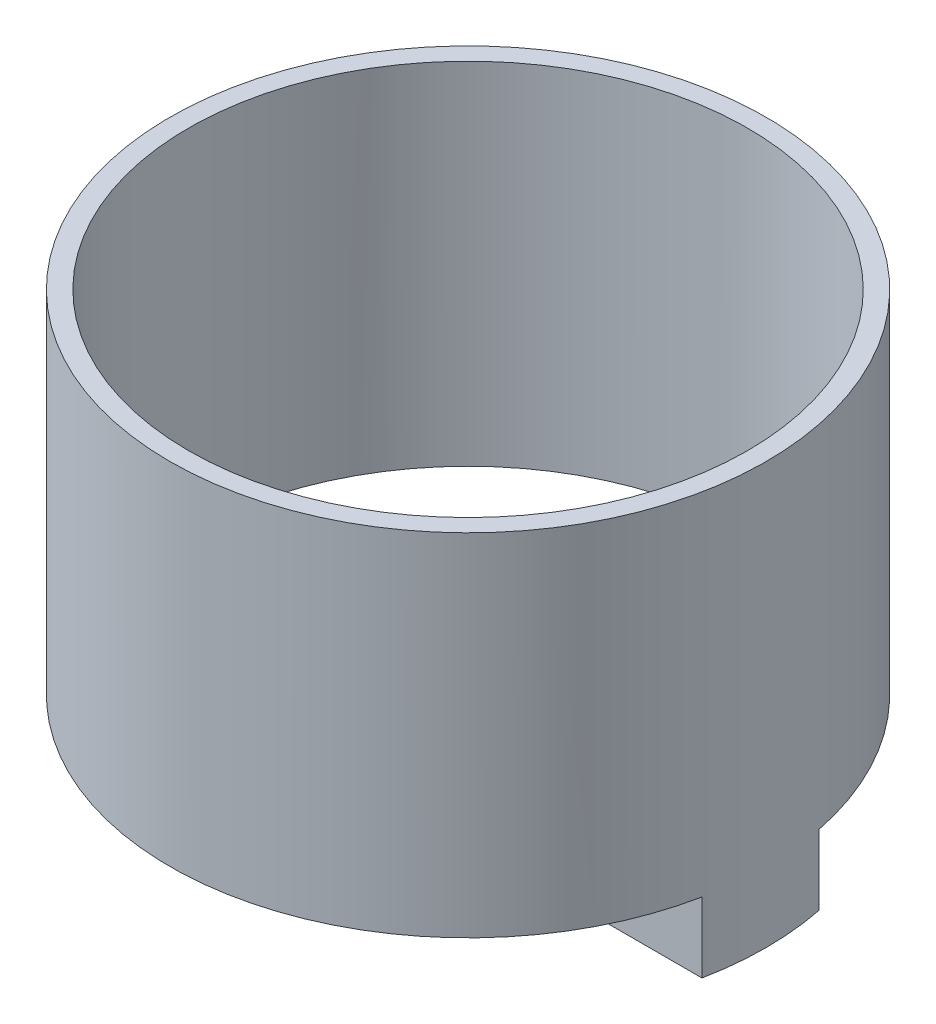
ISO-10303-21;
HEADER;
FILE_DESCRIPTION(('STEP AP214'),'2;1');
FILE_NAME('part.step','',(''),(''),'','','');
FILE_SCHEMA(('AUTOMOTIVE_DESIGN { 1 0 10303 214 1 1 1 1 }'));
ENDSEC;
DATA;
#1=APPLICATION_CONTEXT('core data for automotive mechanical design processes');
#2=APPLICATION_PROTOCOL_DEFINITION('international standard','automotive_design',2000,#1);
#3=PRODUCT_CONTEXT('',#1,'mechanical');
#4=PRODUCT('Part','Part','',(#3));
#5=PRODUCT_RELATED_PRODUCT_CATEGORY('part','',(#4));
#6=PRODUCT_DEFINITION_FORMATION('','',#4);
#7=PRODUCT_DEFINITION_CONTEXT('part definition',#1,'design');
#8=PRODUCT_DEFINITION('design','',#6,#7);
#9=PRODUCT_DEFINITION_SHAPE('','',#8);
#10=(LENGTH_UNIT() NAMED_UNIT(*) SI_UNIT(.MILLI.,.METRE.));
#11=(NAMED_UNIT(*) PLANE_ANGLE_UNIT() SI_UNIT($,.RADIAN.));
#12=(NAMED_UNIT(*) SI_UNIT($,.STERADIAN.) SOLID_ANGLE_UNIT());
#13=UNCERTAINTY_MEASURE_WITH_UNIT(LENGTH_MEASURE(1.E-05),#10,'distance_accuracy_value','');
#14=(GEOMETRIC_REPRESENTATION_CONTEXT(3) GLOBAL_UNCERTAINTY_ASSIGNED_CONTEXT((#13)) GLOBAL_UNIT_ASSIGNED_CONTEXT((#10,
#11,#12)) REPRESENTATION_CONTEXT('',''));
#15=CARTESIAN_POINT('',(0.,0.,0.));
#16=DIRECTION('',(0.,0.,1.));
#17=DIRECTION('',(1.,0.,0.));
#18=AXIS2_PLACEMENT_3D('',#15,#16,#17);
#19=CARTESIAN_POINT('',(0.,0.,0.));
#20=DIRECTION('',(0.,1.,0.));
#21=DIRECTION('',(0.,0.,1.));
#22=AXIS2_PLACEMENT_3D('',#19,#20,#21);
#23=PLANE('',#22);
#24=DIRECTION('',(1.,0.,0.));
#25=VECTOR('',#24,1.);
#26=CARTESIAN_POINT('',(-5.24999999999999,0.,-2.49999999999986));
#27=LINE('',#26,#25);
#28=CARTESIAN_POINT('',(-12.50249975005,0.,-2.5));
#29=VERTEX_POINT('',#28);
#30=CARTESIAN_POINT('',(-11.6855680221374,0.,-2.49999999999999));
#31=VERTEX_POINT('',#30);
#32=EDGE_CURVE('E69',#29,#31,#27,.T.);
#33=ORIENTED_EDGE('',*,*,#32,.F.);
#34=CARTESIAN_POINT('',(0.,0.,0.));
#35=DIRECTION('',(0.,1.,0.));
#36=DIRECTION('',(0.,0.,1.));
#37=AXIS2_PLACEMENT_3D('',#34,#35,#36);
#38=CIRCLE('',#37,12.75);
#39=CARTESIAN_POINT('',(12.50249975005,0.,-2.5));
#40=VERTEX_POINT('',#39);
#41=EDGE_CURVE('E47',#40,#29,#38,.T.);
#42=ORIENTED_EDGE('',*,*,#41,.F.);
#43=DIRECTION('',(1.,0.,0.));
#44=VECTOR('',#43,1.);
#45=CARTESIAN_POINT('',(5.25,0.,-2.5));
#46=LINE('',#45,#44);
#47=CARTESIAN_POINT('',(11.6855680221374,0.,-2.5));
#48=VERTEX_POINT('',#47);
#49=EDGE_CURVE('E11',#48,#40,#46,.T.);
#50=ORIENTED_EDGE('',*,*,#49,.F.);
#51=CARTESIAN_POINT('',(0.,0.,0.));
#52=DIRECTION('',(0.,1.,0.));
#53=DIRECTION('',(0.,0.,1.));
#54=AXIS2_PLACEMENT_3D('',#51,#52,#53);
#55=CIRCLE('',#54,11.95);
#56=EDGE_CURVE('E197',#48,#31,#55,.T.);
#57=ORIENTED_EDGE('',*,*,#56,.T.);
#58=EDGE_LOOP('',(#33,#42,#50,#57));
#59=FACE_BOUND('',#58,.T.);
#60=ADVANCED_FACE('F43',(#59),#23,.F.);
#61=DIRECTION('',(-1.,0.,0.));
#62=VECTOR('',#61,1.);
#63=CARTESIAN_POINT('',(-5.24999999999986,0.,2.50000000000014));
#64=LINE('',#63,#62);
#65=CARTESIAN_POINT('',(-11.6855680221374,0.,2.50000000000001));
#66=VERTEX_POINT('',#65);
#67=CARTESIAN_POINT('',(-12.50249975005,0.,2.5));
#68=VERTEX_POINT('',#67);
#69=EDGE_CURVE('E150',#66,#68,#64,.T.);
#70=ORIENTED_EDGE('',*,*,#69,.F.);
#71=CARTESIAN_POINT('',(11.6855680221374,0.,2.5));
#72=VERTEX_POINT('',#71);
#73=EDGE_CURVE('E191',#66,#72,#55,.T.);
#74=ORIENTED_EDGE('',*,*,#73,.T.);
#75=DIRECTION('',(-1.,0.,0.));
#76=VECTOR('',#75,1.);
#77=CARTESIAN_POINT('',(5.25,0.,2.5));
#78=LINE('',#77,#76);
#79=CARTESIAN_POINT('',(12.50249975005,0.,2.5));
#80=VERTEX_POINT('',#79);
#81=EDGE_CURVE('E174',#80,#72,#78,.T.);
#82=ORIENTED_EDGE('',*,*,#81,.F.);
#83=EDGE_CURVE('E61',#68,#80,#38,.T.);
#84=ORIENTED_EDGE('',*,*,#83,.F.);
#85=EDGE_LOOP('',(#70,#74,#82,#84));
#86=FACE_BOUND('',#85,.T.);
#87=ADVANCED_FACE('F208',(#86),#23,.F.);
#88=CARTESIAN_POINT('',(0.,15.,0.));
#89=DIRECTION('',(0.,1.,0.));
#90=DIRECTION('',(0.,0.,1.));
#91=AXIS2_PLACEMENT_3D('',#88,#89,#90);
#92=PLANE('',#91);
#93=CARTESIAN_POINT('',(0.,15.,0.));
#94=DIRECTION('',(0.,1.,0.));
#95=DIRECTION('',(0.,0.,1.));
#96=AXIS2_PLACEMENT_3D('',#93,#94,#95);
#97=CIRCLE('',#96,12.75);
#98=CARTESIAN_POINT('',(0.,15.,12.75));
#99=VERTEX_POINT('',#98);
#100=EDGE_CURVE('E52',#99,#99,#97,.T.);
#101=ORIENTED_EDGE('',*,*,#100,.T.);
#102=EDGE_LOOP('',(#101));
#103=FACE_BOUND('',#102,.T.);
#104=CARTESIAN_POINT('',(0.,15.,0.));
#105=DIRECTION('',(0.,1.,0.));
#106=DIRECTION('',(0.,0.,1.));
#107=AXIS2_PLACEMENT_3D('',#104,#105,#106);
#108=CIRCLE('',#107,11.95);
#109=CARTESIAN_POINT('',(0.,15.,11.95));
#110=VERTEX_POINT('',#109);
#111=EDGE_CURVE('E192',#110,#110,#108,.T.);
#112=ORIENTED_EDGE('',*,*,#111,.F.);
#113=EDGE_LOOP('',(#112));
#114=FACE_BOUND('',#113,.T.);
#115=ADVANCED_FACE('F244',(#103,#114),#92,.T.);
#116=CARTESIAN_POINT('',(0.,15.,0.));
#117=DIRECTION('',(0.,-1.,0.));
#118=DIRECTION('',(0.,0.,-1.));
#119=AXIS2_PLACEMENT_3D('',#116,#117,#118);
#120=CYLINDRICAL_SURFACE('',#119,12.75);
#121=ORIENTED_EDGE('',*,*,#100,.F.);
#122=EDGE_LOOP('',(#121));
#123=FACE_BOUND('',#122,.T.);
#124=ORIENTED_EDGE('',*,*,#41,.T.);
#125=DIRECTION('',(0.,1.,0.));
#126=VECTOR('',#125,1.);
#127=CARTESIAN_POINT('',(-12.50249975005,-3.,-2.5));
#128=LINE('',#127,#126);
#129=CARTESIAN_POINT('',(-12.50249975005,-3.,-2.5));
#130=VERTEX_POINT('',#129);
#131=EDGE_CURVE('E362',#130,#29,#128,.T.);
#132=ORIENTED_EDGE('',*,*,#131,.F.);
#133=CARTESIAN_POINT('',(0.,-3.,0.));
#134=DIRECTION('',(0.,-1.,0.));
#135=DIRECTION('',(0.,0.,-1.));
#136=AXIS2_PLACEMENT_3D('',#133,#134,#135);
#137=CIRCLE('',#136,12.7500000000001);
#138=CARTESIAN_POINT('',(-12.50249975005,-3.,2.5));
#139=VERTEX_POINT('',#138);
#140=EDGE_CURVE('E152',#139,#130,#137,.T.);
#141=ORIENTED_EDGE('',*,*,#140,.F.);
#142=DIRECTION('',(0.,1.,0.));
#143=VECTOR('',#142,1.);
#144=CARTESIAN_POINT('',(-12.50249975005,-3.,2.5));
#145=LINE('',#144,#143);
#146=EDGE_CURVE('E145',#139,#68,#145,.T.);
#147=ORIENTED_EDGE('',*,*,#146,.T.);
#148=ORIENTED_EDGE('',*,*,#83,.T.);
#149=DIRECTION('',(0.,1.,0.));
#150=VECTOR('',#149,1.);
#151=CARTESIAN_POINT('',(12.50249975005,-3.,2.5));
#152=LINE('',#151,#150);
#153=CARTESIAN_POINT('',(12.50249975005,-3.,2.5));
#154=VERTEX_POINT('',#153);
#155=EDGE_CURVE('E188',#154,#80,#152,.T.);
#156=ORIENTED_EDGE('',*,*,#155,.F.);
#157=CARTESIAN_POINT('',(0.,-3.,0.));
#158=DIRECTION('',(0.,-1.,0.));
#159=DIRECTION('',(0.,0.,1.));
#160=AXIS2_PLACEMENT_3D('',#157,#158,#159);
#161=CIRCLE('',#160,12.7499999999999);
#162=CARTESIAN_POINT('',(12.50249975005,-3.,-2.5));
#163=VERTEX_POINT('',#162);
#164=EDGE_CURVE('E164',#163,#154,#161,.T.);
#165=ORIENTED_EDGE('',*,*,#164,.F.);
#166=DIRECTION('',(0.,1.,0.));
#167=VECTOR('',#166,1.);
#168=CARTESIAN_POINT('',(12.50249975005,-3.,-2.5));
#169=LINE('',#168,#167);
#170=EDGE_CURVE('E173',#163,#40,#169,.T.);
#171=ORIENTED_EDGE('',*,*,#170,.T.);
#172=EDGE_LOOP('',(#124,#132,#141,#147,#148,#156,#165,#171));
#173=FACE_BOUND('',#172,.T.);
#174=ADVANCED_FACE('F45',(#123,#173),#120,.T.);
#175=CARTESIAN_POINT('',(0.,15.,0.));
#176=DIRECTION('',(0.,-1.,0.));
#177=DIRECTION('',(0.,0.,-1.));
#178=AXIS2_PLACEMENT_3D('',#175,#176,#177);
#179=CYLINDRICAL_SURFACE('',#178,11.95);
#180=ORIENTED_EDGE('',*,*,#111,.T.);
#181=EDGE_LOOP('',(#180));
#182=FACE_BOUND('',#181,.T.);
#183=EDGE_CURVE('E195',#72,#48,#55,.T.);
#184=ORIENTED_EDGE('',*,*,#183,.F.);
#185=ORIENTED_EDGE('',*,*,#73,.F.);
#186=EDGE_CURVE('E149',#31,#66,#55,.T.);
#187=ORIENTED_EDGE('',*,*,#186,.F.);
#188=ORIENTED_EDGE('',*,*,#56,.F.);
#189=EDGE_LOOP('',(#184,#185,#187,#188));
#190=FACE_BOUND('',#189,.T.);
#191=ADVANCED_FACE('F223',(#182,#190),#179,.F.);
#192=CARTESIAN_POINT('',(5.25,-3.,2.5));
#193=DIRECTION('',(0.,0.,-1.));
#194=DIRECTION('',(-1.,0.,0.));
#195=AXIS2_PLACEMENT_3D('',#192,#193,#194);
#196=PLANE('',#195);
#197=ORIENTED_EDGE('',*,*,#81,.T.);
#198=CARTESIAN_POINT('',(5.25,0.,2.5));
#199=VERTEX_POINT('',#198);
#200=EDGE_CURVE('E156',#72,#199,#78,.T.);
#201=ORIENTED_EDGE('',*,*,#200,.T.);
#202=DIRECTION('',(0.,1.,0.));
#203=VECTOR('',#202,1.);
#204=CARTESIAN_POINT('',(5.25,-3.,2.5));
#205=LINE('',#204,#203);
#206=CARTESIAN_POINT('',(5.25,-3.,2.5));
#207=VERTEX_POINT('',#206);
#208=EDGE_CURVE('E185',#207,#199,#205,.T.);
#209=ORIENTED_EDGE('',*,*,#208,.F.);
#210=DIRECTION('',(-1.,0.,0.));
#211=VECTOR('',#210,1.);
#212=CARTESIAN_POINT('',(5.25,-3.,2.5));
#213=LINE('',#212,#211);
#214=EDGE_CURVE('E167',#154,#207,#213,.T.);
#215=ORIENTED_EDGE('',*,*,#214,.F.);
#216=ORIENTED_EDGE('',*,*,#155,.T.);
#217=EDGE_LOOP('',(#197,#201,#209,#215,#216));
#218=FACE_BOUND('',#217,.T.);
#219=ADVANCED_FACE('F211',(#218),#196,.F.);
#220=CARTESIAN_POINT('',(5.25,-3.,-2.5));
#221=DIRECTION('',(1.,0.,0.));
#222=DIRECTION('',(0.,0.,-1.));
#223=AXIS2_PLACEMENT_3D('',#220,#221,#222);
#224=PLANE('',#223);
#225=DIRECTION('',(0.,0.,-1.));
#226=VECTOR('',#225,1.);
#227=CARTESIAN_POINT('',(5.25,0.,-2.5));
#228=LINE('',#227,#226);
#229=CARTESIAN_POINT('',(5.25,0.,-2.5));
#230=VERTEX_POINT('',#229);
#231=EDGE_CURVE('E177',#199,#230,#228,.T.);
#232=ORIENTED_EDGE('',*,*,#231,.T.);
#233=DIRECTION('',(0.,1.,0.));
#234=VECTOR('',#233,1.);
#235=CARTESIAN_POINT('',(5.25,-3.,-2.5));
#236=LINE('',#235,#234);
#237=CARTESIAN_POINT('',(5.25,-3.,-2.5));
#238=VERTEX_POINT('',#237);
#239=EDGE_CURVE('E182',#238,#230,#236,.T.);
#240=ORIENTED_EDGE('',*,*,#239,.F.);
#241=DIRECTION('',(0.,0.,-1.));
#242=VECTOR('',#241,1.);
#243=CARTESIAN_POINT('',(5.25,-3.,-2.5));
#244=LINE('',#243,#242);
#245=EDGE_CURVE('E169',#207,#238,#244,.T.);
#246=ORIENTED_EDGE('',*,*,#245,.F.);
#247=ORIENTED_EDGE('',*,*,#208,.T.);
#248=EDGE_LOOP('',(#232,#240,#246,#247));
#249=FACE_BOUND('',#248,.T.);
#250=ADVANCED_FACE('F229',(#249),#224,.F.);
#251=CARTESIAN_POINT('',(5.25,-3.,-2.5));
#252=DIRECTION('',(0.,0.,1.));
#253=DIRECTION('',(1.,0.,0.));
#254=AXIS2_PLACEMENT_3D('',#251,#252,#253);
#255=PLANE('',#254);
#256=EDGE_CURVE('E54',#230,#48,#46,.T.);
#257=ORIENTED_EDGE('',*,*,#256,.T.);
#258=ORIENTED_EDGE('',*,*,#49,.T.);
#259=ORIENTED_EDGE('',*,*,#170,.F.);
#260=DIRECTION('',(1.,0.,0.));
#261=VECTOR('',#260,1.);
#262=CARTESIAN_POINT('',(5.25,-3.,-2.5));
#263=LINE('',#262,#261);
#264=EDGE_CURVE('E171',#238,#163,#263,.T.);
#265=ORIENTED_EDGE('',*,*,#264,.F.);
#266=ORIENTED_EDGE('',*,*,#239,.T.);
#267=EDGE_LOOP('',(#257,#258,#259,#265,#266));
#268=FACE_BOUND('',#267,.T.);
#269=ADVANCED_FACE('F219',(#268),#255,.F.);
#270=CARTESIAN_POINT('',(0.,-3.,0.));
#271=DIRECTION('',(0.,1.,0.));
#272=DIRECTION('',(0.,0.,1.));
#273=AXIS2_PLACEMENT_3D('',#270,#271,#272);
#274=PLANE('',#273);
#275=ORIENTED_EDGE('',*,*,#164,.T.);
#276=ORIENTED_EDGE('',*,*,#214,.T.);
#277=ORIENTED_EDGE('',*,*,#245,.T.);
#278=ORIENTED_EDGE('',*,*,#264,.T.);
#279=EDGE_LOOP('',(#275,#276,#277,#278));
#280=FACE_BOUND('',#279,.T.);
#281=ADVANCED_FACE('F215',(#280),#274,.F.);
#282=CARTESIAN_POINT('',(0.,0.,0.));
#283=DIRECTION('',(0.,1.,0.));
#284=DIRECTION('',(0.,0.,1.));
#285=AXIS2_PLACEMENT_3D('',#282,#283,#284);
#286=PLANE('',#285);
#287=ORIENTED_EDGE('',*,*,#200,.F.);
#288=ORIENTED_EDGE('',*,*,#183,.T.);
#289=ORIENTED_EDGE('',*,*,#256,.F.);
#290=ORIENTED_EDGE('',*,*,#231,.F.);
#291=EDGE_LOOP('',(#287,#288,#289,#290));
#292=FACE_BOUND('',#291,.T.);
#293=ADVANCED_FACE('F226',(#292),#286,.T.);
#294=CARTESIAN_POINT('',(0.,0.,0.));
#295=DIRECTION('',(0.,-1.,0.));
#296=DIRECTION('',(0.,0.,-1.));
#297=AXIS2_PLACEMENT_3D('',#294,#295,#296);
#298=PLANE('',#297);
#299=ORIENTED_EDGE('',*,*,#186,.T.);
#300=CARTESIAN_POINT('',(-5.24999999999986,0.,2.50000000000014));
#301=VERTEX_POINT('',#300);
#302=EDGE_CURVE('E138',#301,#66,#64,.T.);
#303=ORIENTED_EDGE('',*,*,#302,.F.);
#304=DIRECTION('',(0.,0.,1.));
#305=VECTOR('',#304,1.);
#306=CARTESIAN_POINT('',(-5.24999999999999,0.,-2.49999999999986));
#307=LINE('',#306,#305);
#308=CARTESIAN_POINT('',(-5.24999999999999,0.,-2.49999999999986));
#309=VERTEX_POINT('',#308);
#310=EDGE_CURVE('E126',#309,#301,#307,.T.);
#311=ORIENTED_EDGE('',*,*,#310,.F.);
#312=EDGE_CURVE('E137',#31,#309,#27,.T.);
#313=ORIENTED_EDGE('',*,*,#312,.F.);
#314=EDGE_LOOP('',(#299,#303,#311,#313));
#315=FACE_BOUND('',#314,.T.);
#316=ADVANCED_FACE('F148',(#315),#298,.F.);
#317=CARTESIAN_POINT('',(-5.24999999999999,-3.,-2.49999999999986));
#318=DIRECTION('',(0.,0.,1.));
#319=DIRECTION('',(1.,0.,0.));
#320=AXIS2_PLACEMENT_3D('',#317,#318,#319);
#321=PLANE('',#320);
#322=ORIENTED_EDGE('',*,*,#32,.T.);
#323=ORIENTED_EDGE('',*,*,#312,.T.);
#324=DIRECTION('',(0.,1.,0.));
#325=VECTOR('',#324,1.);
#326=CARTESIAN_POINT('',(-5.24999999999999,-3.,-2.49999999999986));
#327=LINE('',#326,#325);
#328=CARTESIAN_POINT('',(-5.24999999999999,-3.,-2.49999999999986));
#329=VERTEX_POINT('',#328);
#330=EDGE_CURVE('E133',#329,#309,#327,.T.);
#331=ORIENTED_EDGE('',*,*,#330,.F.);
#332=DIRECTION('',(1.,0.,0.));
#333=VECTOR('',#332,1.);
#334=CARTESIAN_POINT('',(-5.24999999999999,-3.,-2.49999999999986));
#335=LINE('',#334,#333);
#336=EDGE_CURVE('E160',#130,#329,#335,.T.);
#337=ORIENTED_EDGE('',*,*,#336,.F.);
#338=ORIENTED_EDGE('',*,*,#131,.T.);
#339=EDGE_LOOP('',(#322,#323,#331,#337,#338));
#340=FACE_BOUND('',#339,.T.);
#341=ADVANCED_FACE('F320',(#340),#321,.F.);
#342=CARTESIAN_POINT('',(-5.24999999999999,-3.,-2.49999999999986));
#343=DIRECTION('',(-1.,0.,0.));
#344=DIRECTION('',(0.,0.,1.));
#345=AXIS2_PLACEMENT_3D('',#342,#343,#344);
#346=PLANE('',#345);
#347=ORIENTED_EDGE('',*,*,#310,.T.);
#348=DIRECTION('',(0.,1.,0.));
#349=VECTOR('',#348,1.);
#350=CARTESIAN_POINT('',(-5.24999999999986,-3.,2.50000000000014));
#351=LINE('',#350,#349);
#352=CARTESIAN_POINT('',(-5.24999999999986,-3.,2.50000000000014));
#353=VERTEX_POINT('',#352);
#354=EDGE_CURVE('E130',#353,#301,#351,.T.);
#355=ORIENTED_EDGE('',*,*,#354,.F.);
#356=DIRECTION('',(0.,0.,1.));
#357=VECTOR('',#356,1.);
#358=CARTESIAN_POINT('',(-5.24999999999999,-3.,-2.49999999999986));
#359=LINE('',#358,#357);
#360=EDGE_CURVE('E158',#329,#353,#359,.T.);
#361=ORIENTED_EDGE('',*,*,#360,.F.);
#362=ORIENTED_EDGE('',*,*,#330,.T.);
#363=EDGE_LOOP('',(#347,#355,#361,#362));
#364=FACE_BOUND('',#363,.T.);
#365=ADVANCED_FACE('F128',(#364),#346,.F.);
#366=CARTESIAN_POINT('',(-5.24999999999986,-3.,2.50000000000014));
#367=DIRECTION('',(0.,0.,-1.));
#368=DIRECTION('',(-1.,0.,0.));
#369=AXIS2_PLACEMENT_3D('',#366,#367,#368);
#370=PLANE('',#369);
#371=ORIENTED_EDGE('',*,*,#302,.T.);
#372=ORIENTED_EDGE('',*,*,#69,.T.);
#373=ORIENTED_EDGE('',*,*,#146,.F.);
#374=DIRECTION('',(-1.,0.,0.));
#375=VECTOR('',#374,1.);
#376=CARTESIAN_POINT('',(-5.24999999999986,-3.,2.50000000000014));
#377=LINE('',#376,#375);
#378=EDGE_CURVE('E144',#353,#139,#377,.T.);
#379=ORIENTED_EDGE('',*,*,#378,.F.);
#380=ORIENTED_EDGE('',*,*,#354,.T.);
#381=EDGE_LOOP('',(#371,#372,#373,#379,#380));
#382=FACE_BOUND('',#381,.T.);
#383=ADVANCED_FACE('F142',(#382),#370,.F.);
#384=CARTESIAN_POINT('',(0.,-3.,0.));
#385=DIRECTION('',(0.,-1.,0.));
#386=DIRECTION('',(0.,0.,-1.));
#387=AXIS2_PLACEMENT_3D('',#384,#385,#386);
#388=PLANE('',#387);
#389=ORIENTED_EDGE('',*,*,#140,.T.);
#390=ORIENTED_EDGE('',*,*,#336,.T.);
#391=ORIENTED_EDGE('',*,*,#360,.T.);
#392=ORIENTED_EDGE('',*,*,#378,.T.);
#393=EDGE_LOOP('',(#389,#390,#391,#392));
#394=FACE_BOUND('',#393,.T.);
#395=ADVANCED_FACE('F343',(#394),#388,.T.);
#396=CLOSED_SHELL('',(#60,#87,#115,#174,#191,#219,#250,#269,#281,#293,#316,#341,#365,#383,#395));
#397=MANIFOLD_SOLID_BREP('B2',#396);
#398=ADVANCED_BREP_SHAPE_REPRESENTATION('',(#18,#397),#14);
#399=SHAPE_DEFINITION_REPRESENTATION(#9,#398);
ENDSEC;
END-ISO-10303-21;
